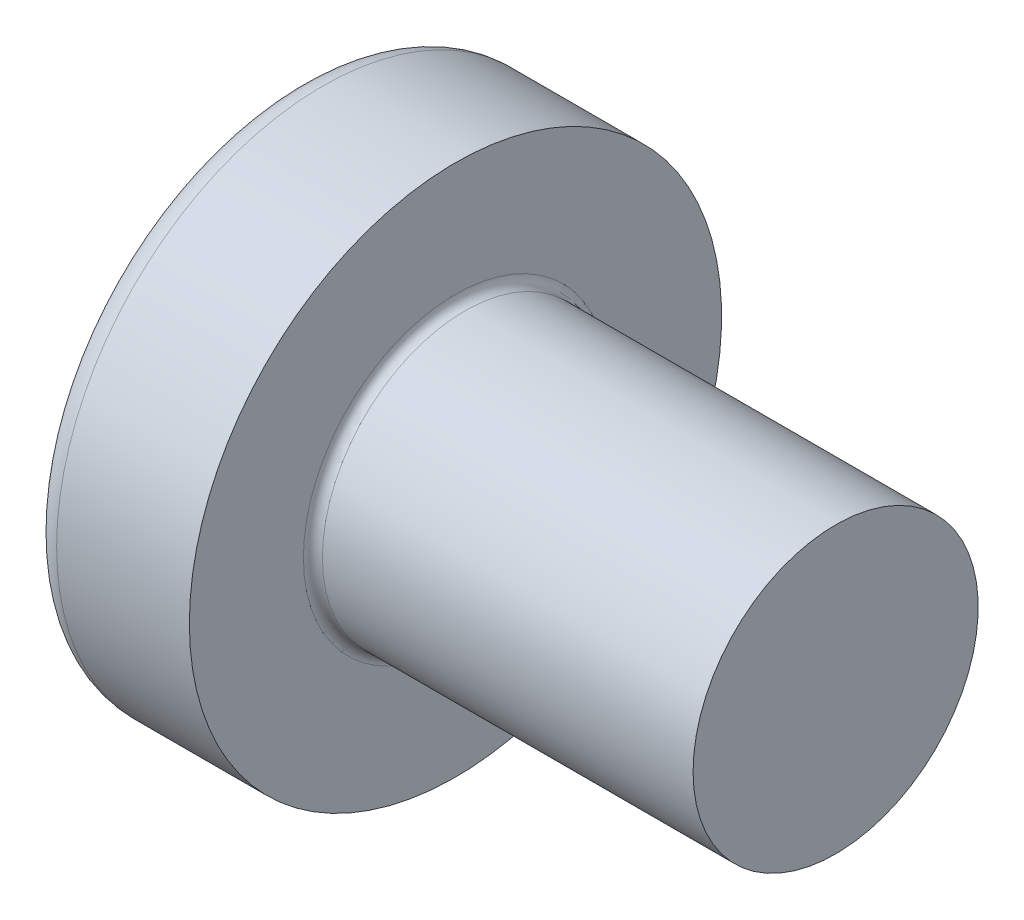
ISO-10303-21;
HEADER;
FILE_DESCRIPTION(('STEP AP214'),'2;1');
FILE_NAME('part.step','',(''),(''),'','','');
FILE_SCHEMA(('AUTOMOTIVE_DESIGN { 1 0 10303 214 1 1 1 1 }'));
ENDSEC;
DATA;
#1=APPLICATION_CONTEXT('core data for automotive mechanical design processes');
#2=APPLICATION_PROTOCOL_DEFINITION('international standard','automotive_design',2000,#1);
#3=PRODUCT_CONTEXT('',#1,'mechanical');
#4=PRODUCT('Part','Part','',(#3));
#5=PRODUCT_RELATED_PRODUCT_CATEGORY('part','',(#4));
#6=PRODUCT_DEFINITION_FORMATION('','',#4);
#7=PRODUCT_DEFINITION_CONTEXT('part definition',#1,'design');
#8=PRODUCT_DEFINITION('design','',#6,#7);
#9=PRODUCT_DEFINITION_SHAPE('','',#8);
#10=(LENGTH_UNIT() NAMED_UNIT(*) SI_UNIT(.MILLI.,.METRE.));
#11=(NAMED_UNIT(*) PLANE_ANGLE_UNIT() SI_UNIT($,.RADIAN.));
#12=(NAMED_UNIT(*) SI_UNIT($,.STERADIAN.) SOLID_ANGLE_UNIT());
#13=UNCERTAINTY_MEASURE_WITH_UNIT(LENGTH_MEASURE(1.E-05),#10,'distance_accuracy_value','');
#14=(GEOMETRIC_REPRESENTATION_CONTEXT(3) GLOBAL_UNCERTAINTY_ASSIGNED_CONTEXT((#13)) GLOBAL_UNIT_ASSIGNED_CONTEXT((#10,
#11,#12)) REPRESENTATION_CONTEXT('',''));
#15=CARTESIAN_POINT('',(0.,0.,0.));
#16=DIRECTION('',(0.,0.,1.));
#17=DIRECTION('',(1.,0.,0.));
#18=AXIS2_PLACEMENT_3D('',#15,#16,#17);
#19=CARTESIAN_POINT('',(5.,0.,0.));
#20=DIRECTION('',(-1.,0.,0.));
#21=DIRECTION('',(0.,1.,0.));
#22=AXIS2_PLACEMENT_3D('',#19,#20,#21);
#23=SPHERICAL_SURFACE('',#22,5.);
#24=CARTESIAN_POINT('',(0.775371598933733,0.,0.));
#25=DIRECTION('',(-1.,0.,0.));
#26=DIRECTION('',(0.,0.,1.));
#27=AXIS2_PLACEMENT_3D('',#24,#25,#26);
#28=CIRCLE('',#27,2.67441860465116);
#29=CARTESIAN_POINT('',(0.775371598933733,0.,2.67441860465116));
#30=VERTEX_POINT('',#29);
#31=EDGE_CURVE('E238',#30,#30,#28,.T.);
#32=ORIENTED_EDGE('',*,*,#31,.T.);
#33=EDGE_LOOP('',(#32));
#34=FACE_BOUND('',#33,.T.);
#35=CARTESIAN_POINT('',(0.0457951200896417,0.,0.));
#36=DIRECTION('',(1.,0.,0.));
#37=DIRECTION('',(0.,0.,-1.));
#38=AXIS2_PLACEMENT_3D('',#35,#36,#37);
#39=CIRCLE('',#38,0.675169614150692);
#40=CARTESIAN_POINT('',(0.0457951200896417,-0.369999999999997,-0.564760133040919));
#41=VERTEX_POINT('',#40);
#42=CARTESIAN_POINT('',(0.0457951200896417,-0.564760133040924,-0.37));
#43=VERTEX_POINT('',#42);
#44=EDGE_CURVE('E374',#41,#43,#39,.F.);
#45=ORIENTED_EDGE('',*,*,#44,.F.);
#46=CARTESIAN_POINT('',(5.,-0.370000000000002,0.));
#47=DIRECTION('',(0.,1.,0.));
#48=DIRECTION('',(0.,0.,1.));
#49=AXIS2_PLACEMENT_3D('',#46,#47,#48);
#50=CIRCLE('',#49,4.98629120689917);
#51=CARTESIAN_POINT('',(0.187869734228639,-0.369999999999995,-1.30633162146802));
#52=VERTEX_POINT('',#51);
#53=EDGE_CURVE('E300',#52,#41,#50,.T.);
#54=ORIENTED_EDGE('',*,*,#53,.F.);
#55=CARTESIAN_POINT('',(4.56358262530798,0.,0.875317983305919));
#56=DIRECTION('',(0.446197753347436,0.,-0.894934391398443));
#57=DIRECTION('',(-0.894934391398443,0.,-0.446197753347436));
#58=AXIS2_PLACEMENT_3D('',#55,#56,#57);
#59=CIRCLE('',#58,4.90340272700175);
#60=CARTESIAN_POINT('',(0.187869734228639,0.370000000000005,-1.30633162146802));
#61=VERTEX_POINT('',#60);
#62=EDGE_CURVE('E272',#52,#61,#59,.T.);
#63=ORIENTED_EDGE('',*,*,#62,.T.);
#64=CARTESIAN_POINT('',(5.,0.369999999999999,0.));
#65=DIRECTION('',(0.,-1.,0.));
#66=DIRECTION('',(0.,0.,-1.));
#67=AXIS2_PLACEMENT_3D('',#64,#65,#66);
#68=CIRCLE('',#67,4.98629120689917);
#69=CARTESIAN_POINT('',(0.0457951200896424,0.370000000000002,-0.564760133040916));
#70=VERTEX_POINT('',#69);
#71=EDGE_CURVE('E327',#70,#61,#68,.T.);
#72=ORIENTED_EDGE('',*,*,#71,.F.);
#73=CARTESIAN_POINT('',(0.0457951200896417,0.564760133040913,-0.37));
#74=VERTEX_POINT('',#73);
#75=EDGE_CURVE('E393',#74,#70,#39,.F.);
#76=ORIENTED_EDGE('',*,*,#75,.F.);
#77=CARTESIAN_POINT('',(5.,0.,-0.369999999999999));
#78=DIRECTION('',(0.,0.,1.));
#79=DIRECTION('',(1.,0.,0.));
#80=AXIS2_PLACEMENT_3D('',#77,#78,#79);
#81=CIRCLE('',#80,4.98629120689917);
#82=CARTESIAN_POINT('',(0.187869734228641,1.30633162146802,-0.37));
#83=VERTEX_POINT('',#82);
#84=EDGE_CURVE('E266',#83,#74,#81,.T.);
#85=ORIENTED_EDGE('',*,*,#84,.F.);
#86=CARTESIAN_POINT('',(4.56358262530798,-0.875317983305921,0.));
#87=DIRECTION('',(0.446197753347436,0.894934391398443,0.));
#88=DIRECTION('',(-0.894934391398443,0.446197753347436,0.));
#89=AXIS2_PLACEMENT_3D('',#86,#87,#88);
#90=CIRCLE('',#89,4.90340272700175);
#91=CARTESIAN_POINT('',(0.187869734228641,1.30633162146802,0.370000000000001));
#92=VERTEX_POINT('',#91);
#93=EDGE_CURVE('E269',#83,#92,#90,.T.);
#94=ORIENTED_EDGE('',*,*,#93,.T.);
#95=CARTESIAN_POINT('',(5.,0.,0.370000000000002));
#96=DIRECTION('',(0.,0.,-1.));
#97=DIRECTION('',(-1.,0.,0.));
#98=AXIS2_PLACEMENT_3D('',#95,#96,#97);
#99=CIRCLE('',#98,4.98629120689917);
#100=CARTESIAN_POINT('',(0.0457951200896417,0.564760133040909,0.369999999999999));
#101=VERTEX_POINT('',#100);
#102=EDGE_CURVE('E262',#101,#92,#99,.T.);
#103=ORIENTED_EDGE('',*,*,#102,.F.);
#104=CARTESIAN_POINT('',(0.0457951200896434,0.369999999999998,0.564760133040918));
#105=VERTEX_POINT('',#104);
#106=EDGE_CURVE('E431',#105,#101,#39,.F.);
#107=ORIENTED_EDGE('',*,*,#106,.F.);
#108=CARTESIAN_POINT('',(0.18786973422864,0.369999999999995,1.30633162146802));
#109=VERTEX_POINT('',#108);
#110=EDGE_CURVE('E282',#109,#105,#68,.T.);
#111=ORIENTED_EDGE('',*,*,#110,.F.);
#112=CARTESIAN_POINT('',(4.56358262530798,0.,-0.87531798330592));
#113=DIRECTION('',(0.446197753347436,0.,0.894934391398443));
#114=DIRECTION('',(0.894934391398443,0.,-0.446197753347436));
#115=AXIS2_PLACEMENT_3D('',#112,#113,#114);
#116=CIRCLE('',#115,4.90340272700175);
#117=CARTESIAN_POINT('',(0.187869734228639,-0.370000000000006,1.30633162146802));
#118=VERTEX_POINT('',#117);
#119=EDGE_CURVE('E49',#109,#118,#116,.T.);
#120=ORIENTED_EDGE('',*,*,#119,.T.);
#121=CARTESIAN_POINT('',(0.0457951200896408,-0.370000000000001,0.564760133040917));
#122=VERTEX_POINT('',#121);
#123=EDGE_CURVE('E279',#122,#118,#50,.T.);
#124=ORIENTED_EDGE('',*,*,#123,.F.);
#125=CARTESIAN_POINT('',(0.0457951200896417,-0.56476013304092,0.369999999999999));
#126=VERTEX_POINT('',#125);
#127=EDGE_CURVE('E392',#126,#122,#39,.F.);
#128=ORIENTED_EDGE('',*,*,#127,.F.);
#129=CARTESIAN_POINT('',(0.187869734228638,-1.30633162146802,0.369999999999999));
#130=VERTEX_POINT('',#129);
#131=EDGE_CURVE('E263',#130,#126,#99,.T.);
#132=ORIENTED_EDGE('',*,*,#131,.F.);
#133=CARTESIAN_POINT('',(4.56358262530798,0.875317983305917,0.));
#134=DIRECTION('',(0.446197753347436,-0.894934391398443,0.));
#135=DIRECTION('',(0.894934391398443,0.446197753347436,0.));
#136=AXIS2_PLACEMENT_3D('',#133,#134,#135);
#137=CIRCLE('',#136,4.90340272700175);
#138=CARTESIAN_POINT('',(0.187869734228638,-1.30633162146802,-0.37));
#139=VERTEX_POINT('',#138);
#140=EDGE_CURVE('E259',#130,#139,#137,.T.);
#141=ORIENTED_EDGE('',*,*,#140,.T.);
#142=EDGE_CURVE('E64',#43,#139,#81,.T.);
#143=ORIENTED_EDGE('',*,*,#142,.F.);
#144=EDGE_LOOP('',(#45,#54,#63,#72,#76,#85,#94,#103,#107,#111,#120,#124,#128,#132,#141,#143));
#145=FACE_BOUND('',#144,.T.);
#146=ADVANCED_FACE('F35',(#34,#145),#23,.T.);
#147=CARTESIAN_POINT('',(1.75,0.527482331818931,-0.37));
#148=DIRECTION('',(0.,0.,1.));
#149=DIRECTION('',(1.,0.,0.));
#150=AXIS2_PLACEMENT_3D('',#147,#148,#149);
#151=PLANE('',#150);
#152=ORIENTED_EDGE('',*,*,#84,.T.);
#153=CARTESIAN_POINT('',(-0.987293237069636,0.649401255968442,-0.37));
#154=CARTESIAN_POINT('',(-0.781914975331302,0.632865887004023,-0.37));
#155=CARTESIAN_POINT('',(-0.576547882405889,0.616188977636102,-0.37));
#156=CARTESIAN_POINT('',(-0.165841599235441,0.582441031964983,-0.37));
#157=CARTESIAN_POINT('',(0.0394975903016328,0.5653699870555,-0.37));
#158=CARTESIAN_POINT('',(0.4501334754206,0.530723441326706,-0.37));
#159=CARTESIAN_POINT('',(0.65543017101234,0.513147940624409,-0.37));
#160=CARTESIAN_POINT('',(1.06596140178858,0.477314957984981,-0.37));
#161=CARTESIAN_POINT('',(1.27119593782008,0.459057485804908,-0.37));
#162=CARTESIAN_POINT('',(1.61065292367297,0.428051938687225,-0.37));
#163=CARTESIAN_POINT('',(1.74490059997313,0.415580824989367,-0.37));
#164=CARTESIAN_POINT('',(2.01334321764434,0.390092023403371,-0.37));
#165=CARTESIAN_POINT('',(2.14753815936247,0.377074339175719,-0.37));
#166=CARTESIAN_POINT('',(2.41586354153627,0.350315629451146,-0.37));
#167=CARTESIAN_POINT('',(2.54999397846979,0.336574568175918,-0.37));
#168=CARTESIAN_POINT('',(2.8181417329714,0.308004077740054,-0.37));
#169=CARTESIAN_POINT('',(2.95215904766802,0.29317462174519,-0.37));
#170=CARTESIAN_POINT('',(3.08609550685347,0.277618485069874,-0.37));
#171=B_SPLINE_CURVE_WITH_KNOTS('',3,(#153,#154,#155,#156,#157,#158,#159,#160,#161,#162,#163,
#164,#165,#166,#167,#168,#169,#170),.UNSPECIFIED.,.F.,.F.,(4,2,2,2,2,2,2,2,4),(0.,
0.61812879398981,1.23627109813549,1.85441325889711,2.47254657920086,2.87702276221884,
3.28149623681437,3.68598973554218,4.09049321035586),.UNSPECIFIED.);
#172=CARTESIAN_POINT('',(1.75,0.415013252800437,-0.37));
#173=VERTEX_POINT('',#172);
#174=EDGE_CURVE('E416',#74,#173,#171,.T.);
#175=ORIENTED_EDGE('',*,*,#174,.T.);
#176=DIRECTION('',(0.,1.,0.));
#177=VECTOR('',#176,1.);
#178=CARTESIAN_POINT('',(1.75,-0.527482331818932,-0.37));
#179=LINE('',#178,#177);
#180=CARTESIAN_POINT('',(1.75,0.527482331818931,-0.37));
#181=VERTEX_POINT('',#180);
#182=EDGE_CURVE('E356',#173,#181,#179,.T.);
#183=ORIENTED_EDGE('',*,*,#182,.T.);
#184=DIRECTION('',(0.894934391398442,-0.446197753347436,0.));
#185=VECTOR('',#184,1.);
#186=CARTESIAN_POINT('',(0.,1.4,-0.37));
#187=LINE('',#186,#185);
#188=EDGE_CURVE('E239',#83,#181,#187,.T.);
#189=ORIENTED_EDGE('',*,*,#188,.F.);
#190=EDGE_LOOP('',(#152,#175,#183,#189));
#191=FACE_BOUND('',#190,.T.);
#192=ADVANCED_FACE('F194',(#191),#151,.T.);
#193=CARTESIAN_POINT('',(1.75,-0.527482331818932,-0.37));
#194=VERTEX_POINT('',#193);
#195=CARTESIAN_POINT('',(1.75,-0.415013252800437,-0.37));
#196=VERTEX_POINT('',#195);
#197=EDGE_CURVE('E247',#194,#196,#179,.T.);
#198=ORIENTED_EDGE('',*,*,#197,.T.);
#199=CARTESIAN_POINT('',(-0.987293237069636,-0.649401255968442,-0.37));
#200=CARTESIAN_POINT('',(-0.781914975331303,-0.632865887004023,-0.37));
#201=CARTESIAN_POINT('',(-0.57654788240589,-0.616188977636102,-0.37));
#202=CARTESIAN_POINT('',(-0.165841599235441,-0.582441031964983,-0.37));
#203=CARTESIAN_POINT('',(0.0394975903016326,-0.5653699870555,-0.37));
#204=CARTESIAN_POINT('',(0.4501334754206,-0.530723441326706,-0.37));
#205=CARTESIAN_POINT('',(0.65543017101234,-0.513147940624409,-0.37));
#206=CARTESIAN_POINT('',(1.06596140178858,-0.477314957984981,-0.37));
#207=CARTESIAN_POINT('',(1.27119593782008,-0.459057485804908,-0.37));
#208=CARTESIAN_POINT('',(1.61065292367297,-0.428051938687225,-0.37));
#209=CARTESIAN_POINT('',(1.74490059997313,-0.415580824989368,-0.37));
#210=CARTESIAN_POINT('',(2.01334321764433,-0.390092023403371,-0.37));
#211=CARTESIAN_POINT('',(2.14753815936247,-0.377074339175718,-0.37));
#212=CARTESIAN_POINT('',(2.41586354153627,-0.350315629451146,-0.37));
#213=CARTESIAN_POINT('',(2.54999397846979,-0.336574568175918,-0.37));
#214=CARTESIAN_POINT('',(2.8181417329714,-0.308004077740054,-0.37));
#215=CARTESIAN_POINT('',(2.95215904766802,-0.29317462174519,-0.37));
#216=CARTESIAN_POINT('',(3.08609550685347,-0.277618485069873,-0.37));
#217=B_SPLINE_CURVE_WITH_KNOTS('',3,(#199,#200,#201,#202,#203,#204,#205,#206,#207,#208,#209,
#210,#211,#212,#213,#214,#215,#216),.UNSPECIFIED.,.F.,.F.,(4,2,2,2,2,2,2,2,4),(0.,
0.61812879398981,1.2362710981355,1.85441325889711,2.47254657920086,2.87702276221884,
3.28149623681437,3.68598973554218,4.09049321035587),.UNSPECIFIED.);
#218=EDGE_CURVE('E391',#196,#43,#217,.F.);
#219=ORIENTED_EDGE('',*,*,#218,.T.);
#220=ORIENTED_EDGE('',*,*,#142,.T.);
#221=DIRECTION('',(0.894934391398443,0.446197753347436,0.));
#222=VECTOR('',#221,1.);
#223=CARTESIAN_POINT('',(0.,-1.4,-0.37));
#224=LINE('',#223,#222);
#225=EDGE_CURVE('E330',#139,#194,#224,.T.);
#226=ORIENTED_EDGE('',*,*,#225,.T.);
#227=EDGE_LOOP('',(#198,#219,#220,#226));
#228=FACE_BOUND('',#227,.T.);
#229=ADVANCED_FACE('F200',(#228),#151,.T.);
#230=CARTESIAN_POINT('',(1.75,-0.527482331818932,0.37));
#231=DIRECTION('',(0.,0.,-1.));
#232=DIRECTION('',(-1.,0.,0.));
#233=AXIS2_PLACEMENT_3D('',#230,#231,#232);
#234=PLANE('',#233);
#235=DIRECTION('',(0.,-1.,0.));
#236=VECTOR('',#235,1.);
#237=CARTESIAN_POINT('',(1.75,0.527482331818931,0.37));
#238=LINE('',#237,#236);
#239=CARTESIAN_POINT('',(1.75,0.527482331818931,0.37));
#240=VERTEX_POINT('',#239);
#241=CARTESIAN_POINT('',(1.75,0.415013252800437,0.37));
#242=VERTEX_POINT('',#241);
#243=EDGE_CURVE('E339',#240,#242,#238,.T.);
#244=ORIENTED_EDGE('',*,*,#243,.T.);
#245=CARTESIAN_POINT('',(-0.987293237053716,0.649401255967162,0.369999999999998));
#246=CARTESIAN_POINT('',(-0.781914975317084,0.632865887002872,0.369999999999998));
#247=CARTESIAN_POINT('',(-0.576547882393372,0.616188977635082,0.369999999999998));
#248=CARTESIAN_POINT('',(-0.165841599226327,0.582441031964228,0.369999999999999));
#249=CARTESIAN_POINT('',(0.0394975903090454,0.56536998705488,0.369999999999999));
#250=CARTESIAN_POINT('',(0.450133475422572,0.530723441326535,0.369999999999999));
#251=CARTESIAN_POINT('',(0.655430171010573,0.513147940624557,0.369999999999999));
#252=CARTESIAN_POINT('',(1.06596140177934,0.477314957985794,0.37));
#253=CARTESIAN_POINT('',(1.2711959378071,0.459057485806066,0.37));
#254=CARTESIAN_POINT('',(1.61065292365626,0.428051938688769,0.37));
#255=CARTESIAN_POINT('',(1.74490059995643,0.415580824990931,0.37));
#256=CARTESIAN_POINT('',(2.01334321762763,0.390092023404979,0.37));
#257=CARTESIAN_POINT('',(2.14753815934577,0.377074339177353,0.37));
#258=CARTESIAN_POINT('',(2.41586354151957,0.350315629452842,0.37));
#259=CARTESIAN_POINT('',(2.5499939784531,0.336574568177649,0.370000000000001));
#260=CARTESIAN_POINT('',(2.81814173295471,0.308004077741874,0.370000000000001));
#261=CARTESIAN_POINT('',(2.95215904765134,0.293174621747063,0.370000000000001));
#262=CARTESIAN_POINT('',(3.0860955068368,0.277618485071814,0.370000000000001));
#263=B_SPLINE_CURVE_WITH_KNOTS('',3,(#245,#246,#247,#248,#249,#250,#251,#252,#253,#254,#255,
#256,#257,#258,#259,#260,#261,#262),.UNSPECIFIED.,.F.,.F.,(4,2,2,2,2,2,2,2,4),(0.,
0.618128793984691,1.23627109812525,1.85441325887562,2.4725465791681,2.87702276218609,
3.28149623678161,3.68598973550942,4.09049321032311),.UNSPECIFIED.);
#264=EDGE_CURVE('E432',#242,#101,#263,.F.);
#265=ORIENTED_EDGE('',*,*,#264,.T.);
#266=ORIENTED_EDGE('',*,*,#102,.T.);
#267=DIRECTION('',(0.894934391398442,-0.446197753347436,0.));
#268=VECTOR('',#267,1.);
#269=CARTESIAN_POINT('',(0.,1.4,0.37));
#270=LINE('',#269,#268);
#271=EDGE_CURVE('E244',#92,#240,#270,.T.);
#272=ORIENTED_EDGE('',*,*,#271,.T.);
#273=EDGE_LOOP('',(#244,#265,#266,#272));
#274=FACE_BOUND('',#273,.T.);
#275=ADVANCED_FACE('F412',(#274),#234,.T.);
#276=ORIENTED_EDGE('',*,*,#131,.T.);
#277=CARTESIAN_POINT('',(-0.987293237053716,-0.649401255967162,0.369999999999998));
#278=CARTESIAN_POINT('',(-0.781914975317084,-0.632865887002872,0.369999999999998));
#279=CARTESIAN_POINT('',(-0.576547882393373,-0.616188977635082,0.369999999999999));
#280=CARTESIAN_POINT('',(-0.165841599226327,-0.582441031964228,0.369999999999999));
#281=CARTESIAN_POINT('',(0.0394975903090454,-0.56536998705488,0.369999999999999));
#282=CARTESIAN_POINT('',(0.450133475422572,-0.530723441326535,0.369999999999999));
#283=CARTESIAN_POINT('',(0.655430171010573,-0.513147940624557,0.369999999999999));
#284=CARTESIAN_POINT('',(1.06596140177934,-0.477314957985794,0.37));
#285=CARTESIAN_POINT('',(1.2711959378071,-0.459057485806066,0.37));
#286=CARTESIAN_POINT('',(1.61065292365626,-0.428051938688769,0.37));
#287=CARTESIAN_POINT('',(1.74490059995643,-0.415580824990931,0.37));
#288=CARTESIAN_POINT('',(2.01334321762763,-0.390092023404979,0.37));
#289=CARTESIAN_POINT('',(2.14753815934577,-0.377074339177353,0.37));
#290=CARTESIAN_POINT('',(2.41586354151957,-0.350315629452842,0.370000000000001));
#291=CARTESIAN_POINT('',(2.5499939784531,-0.336574568177649,0.370000000000001));
#292=CARTESIAN_POINT('',(2.81814173295471,-0.308004077741874,0.370000000000001));
#293=CARTESIAN_POINT('',(2.95215904765134,-0.293174621747064,0.370000000000001));
#294=CARTESIAN_POINT('',(3.0860955068368,-0.277618485071814,0.370000000000001));
#295=B_SPLINE_CURVE_WITH_KNOTS('',3,(#277,#278,#279,#280,#281,#282,#283,#284,#285,#286,#287,
#288,#289,#290,#291,#292,#293,#294),.UNSPECIFIED.,.F.,.F.,(4,2,2,2,2,2,2,2,4),(0.,
0.618128793984691,1.23627109812525,1.85441325887562,2.4725465791681,2.87702276218609,
3.28149623678161,3.68598973550942,4.09049321032311),.UNSPECIFIED.);
#296=CARTESIAN_POINT('',(1.75,-0.415013252800437,0.370000000000001));
#297=VERTEX_POINT('',#296);
#298=EDGE_CURVE('E453',#126,#297,#295,.T.);
#299=ORIENTED_EDGE('',*,*,#298,.T.);
#300=CARTESIAN_POINT('',(1.75,-0.527482331818932,0.37));
#301=VERTEX_POINT('',#300);
#302=EDGE_CURVE('E341',#297,#301,#238,.T.);
#303=ORIENTED_EDGE('',*,*,#302,.T.);
#304=DIRECTION('',(0.894934391398443,0.446197753347436,0.));
#305=VECTOR('',#304,1.);
#306=CARTESIAN_POINT('',(0.,-1.4,0.369999999999999));
#307=LINE('',#306,#305);
#308=EDGE_CURVE('E332',#130,#301,#307,.T.);
#309=ORIENTED_EDGE('',*,*,#308,.F.);
#310=EDGE_LOOP('',(#276,#299,#303,#309));
#311=FACE_BOUND('',#310,.T.);
#312=ADVANCED_FACE('F515',(#311),#234,.T.);
#313=CARTESIAN_POINT('',(1.75,0.527482331818931,0.37));
#314=DIRECTION('',(0.446197753347436,0.894934391398443,0.));
#315=DIRECTION('',(-0.894934391398443,0.446197753347436,0.));
#316=AXIS2_PLACEMENT_3D('',#313,#314,#315);
#317=PLANE('',#316);
#318=CARTESIAN_POINT('',(2.6696526882832,0.0689604923233255,0.));
#319=DIRECTION('',(0.446197753347436,0.894934391398443,0.));
#320=DIRECTION('',(-0.894934391398443,0.446197753347436,0.));
#321=AXIS2_PLACEMENT_3D('',#318,#319,#320);
#322=ELLIPSE('',#321,1.10195897609153,0.486831694838766);
#323=CARTESIAN_POINT('',(1.75,0.527482331818932,0.175779377683682));
#324=VERTEX_POINT('',#323);
#325=CARTESIAN_POINT('',(1.75,0.527482331818932,-0.175779377683682));
#326=VERTEX_POINT('',#325);
#327=EDGE_CURVE('E305',#324,#326,#322,.F.);
#328=ORIENTED_EDGE('',*,*,#327,.F.);
#329=DIRECTION('',(0.,0.,-1.));
#330=VECTOR('',#329,1.);
#331=CARTESIAN_POINT('',(1.75,0.527482331818931,0.37));
#332=LINE('',#331,#330);
#333=EDGE_CURVE('E342',#240,#324,#332,.T.);
#334=ORIENTED_EDGE('',*,*,#333,.F.);
#335=ORIENTED_EDGE('',*,*,#271,.F.);
#336=ORIENTED_EDGE('',*,*,#93,.F.);
#337=ORIENTED_EDGE('',*,*,#188,.T.);
#338=EDGE_CURVE('E344',#326,#181,#332,.T.);
#339=ORIENTED_EDGE('',*,*,#338,.F.);
#340=EDGE_LOOP('',(#328,#334,#335,#336,#337,#339));
#341=FACE_BOUND('',#340,.T.);
#342=ADVANCED_FACE('F410',(#341),#317,.F.);
#343=CARTESIAN_POINT('',(1.75,-0.527482331818932,-0.37));
#344=DIRECTION('',(0.446197753347436,-0.894934391398443,0.));
#345=DIRECTION('',(0.894934391398443,0.446197753347436,0.));
#346=AXIS2_PLACEMENT_3D('',#343,#344,#345);
#347=PLANE('',#346);
#348=CARTESIAN_POINT('',(2.6696526882832,-0.0689604923233255,0.));
#349=DIRECTION('',(0.446197753347436,-0.894934391398443,0.));
#350=DIRECTION('',(-0.894934391398443,-0.446197753347436,0.));
#351=AXIS2_PLACEMENT_3D('',#348,#349,#350);
#352=ELLIPSE('',#351,1.10195897609154,0.486831694838766);
#353=CARTESIAN_POINT('',(1.75,-0.527482331818932,-0.175779377683679));
#354=VERTEX_POINT('',#353);
#355=CARTESIAN_POINT('',(1.75,-0.527482331818932,0.175779377683679));
#356=VERTEX_POINT('',#355);
#357=EDGE_CURVE('E459',#354,#356,#352,.F.);
#358=ORIENTED_EDGE('',*,*,#357,.F.);
#359=DIRECTION('',(0.,0.,1.));
#360=VECTOR('',#359,1.);
#361=CARTESIAN_POINT('',(1.75,-0.527482331818932,-0.37));
#362=LINE('',#361,#360);
#363=EDGE_CURVE('E335',#194,#354,#362,.T.);
#364=ORIENTED_EDGE('',*,*,#363,.F.);
#365=ORIENTED_EDGE('',*,*,#225,.F.);
#366=ORIENTED_EDGE('',*,*,#140,.F.);
#367=ORIENTED_EDGE('',*,*,#308,.T.);
#368=EDGE_CURVE('E338',#356,#301,#362,.T.);
#369=ORIENTED_EDGE('',*,*,#368,.F.);
#370=EDGE_LOOP('',(#358,#364,#365,#366,#367,#369));
#371=FACE_BOUND('',#370,.T.);
#372=ADVANCED_FACE('F507',(#371),#347,.F.);
#373=CARTESIAN_POINT('',(1.75,-0.527482331818932,-0.37));
#374=DIRECTION('',(1.,0.,0.));
#375=DIRECTION('',(0.,0.,-1.));
#376=AXIS2_PLACEMENT_3D('',#373,#374,#375);
#377=PLANE('',#376);
#378=CARTESIAN_POINT('',(1.75,0.,0.));
#379=DIRECTION('',(-1.,0.,0.));
#380=DIRECTION('',(0.,0.,1.));
#381=AXIS2_PLACEMENT_3D('',#378,#379,#380);
#382=CIRCLE('',#381,0.556);
#383=CARTESIAN_POINT('',(1.75,-0.175779377683679,-0.527482331818933));
#384=VERTEX_POINT('',#383);
#385=CARTESIAN_POINT('',(1.75,-0.369999999999999,-0.415013252800438));
#386=VERTEX_POINT('',#385);
#387=EDGE_CURVE('E56',#384,#386,#382,.T.);
#388=ORIENTED_EDGE('',*,*,#387,.F.);
#389=DIRECTION('',(0.,-1.,0.));
#390=VECTOR('',#389,1.);
#391=CARTESIAN_POINT('',(1.75,0.370000000000002,-0.527482331818931));
#392=LINE('',#391,#390);
#393=CARTESIAN_POINT('',(1.75,-0.369999999999998,-0.527482331818933));
#394=VERTEX_POINT('',#393);
#395=EDGE_CURVE('E315',#384,#394,#392,.T.);
#396=ORIENTED_EDGE('',*,*,#395,.T.);
#397=DIRECTION('',(0.,0.,-1.));
#398=VECTOR('',#397,1.);
#399=CARTESIAN_POINT('',(1.75,-0.370000000000002,0.52748233181893));
#400=LINE('',#399,#398);
#401=EDGE_CURVE('E319',#386,#394,#400,.T.);
#402=ORIENTED_EDGE('',*,*,#401,.F.);
#403=EDGE_LOOP('',(#388,#396,#402));
#404=FACE_BOUND('',#403,.T.);
#405=ADVANCED_FACE('F380',(#404),#377,.F.);
#406=EDGE_CURVE('E385',#196,#354,#382,.T.);
#407=ORIENTED_EDGE('',*,*,#406,.F.);
#408=ORIENTED_EDGE('',*,*,#197,.F.);
#409=ORIENTED_EDGE('',*,*,#363,.T.);
#410=EDGE_LOOP('',(#407,#408,#409));
#411=FACE_BOUND('',#410,.T.);
#412=ADVANCED_FACE('F514',(#411),#377,.F.);
#413=EDGE_CURVE('E522',#356,#297,#382,.T.);
#414=ORIENTED_EDGE('',*,*,#413,.F.);
#415=ORIENTED_EDGE('',*,*,#368,.T.);
#416=ORIENTED_EDGE('',*,*,#302,.F.);
#417=EDGE_LOOP('',(#414,#415,#416));
#418=FACE_BOUND('',#417,.T.);
#419=ADVANCED_FACE('F503',(#418),#377,.F.);
#420=CARTESIAN_POINT('',(1.75,-0.370000000000001,0.415013252800436));
#421=VERTEX_POINT('',#420);
#422=CARTESIAN_POINT('',(1.75,-0.175779377683685,0.527482331818931));
#423=VERTEX_POINT('',#422);
#424=EDGE_CURVE('E490',#421,#423,#382,.T.);
#425=ORIENTED_EDGE('',*,*,#424,.F.);
#426=CARTESIAN_POINT('',(1.75,-0.370000000000002,0.52748233181893));
#427=VERTEX_POINT('',#426);
#428=EDGE_CURVE('E316',#427,#421,#400,.T.);
#429=ORIENTED_EDGE('',*,*,#428,.F.);
#430=DIRECTION('',(0.,1.,0.));
#431=VECTOR('',#430,1.);
#432=CARTESIAN_POINT('',(1.75,-0.370000000000002,0.52748233181893));
#433=LINE('',#432,#431);
#434=EDGE_CURVE('E320',#427,#423,#433,.T.);
#435=ORIENTED_EDGE('',*,*,#434,.T.);
#436=EDGE_LOOP('',(#425,#429,#435));
#437=FACE_BOUND('',#436,.T.);
#438=ADVANCED_FACE('F488',(#437),#377,.F.);
#439=CARTESIAN_POINT('',(1.75,0.175779377683682,0.527482331818932));
#440=VERTEX_POINT('',#439);
#441=CARTESIAN_POINT('',(1.75,0.369999999999998,0.415013252800439));
#442=VERTEX_POINT('',#441);
#443=EDGE_CURVE('E386',#440,#442,#382,.T.);
#444=ORIENTED_EDGE('',*,*,#443,.F.);
#445=CARTESIAN_POINT('',(1.75,0.369999999999998,0.527482331818932));
#446=VERTEX_POINT('',#445);
#447=EDGE_CURVE('E323',#440,#446,#433,.T.);
#448=ORIENTED_EDGE('',*,*,#447,.T.);
#449=DIRECTION('',(0.,0.,1.));
#450=VECTOR('',#449,1.);
#451=CARTESIAN_POINT('',(1.75,0.370000000000002,-0.527482331818931));
#452=LINE('',#451,#450);
#453=EDGE_CURVE('E297',#442,#446,#452,.T.);
#454=ORIENTED_EDGE('',*,*,#453,.F.);
#455=EDGE_LOOP('',(#444,#448,#454));
#456=FACE_BOUND('',#455,.T.);
#457=ADVANCED_FACE('F496',(#456),#377,.F.);
#458=EDGE_CURVE('E473',#242,#324,#382,.T.);
#459=ORIENTED_EDGE('',*,*,#458,.F.);
#460=ORIENTED_EDGE('',*,*,#243,.F.);
#461=ORIENTED_EDGE('',*,*,#333,.T.);
#462=EDGE_LOOP('',(#459,#460,#461));
#463=FACE_BOUND('',#462,.T.);
#464=ADVANCED_FACE('F498',(#463),#377,.F.);
#465=EDGE_CURVE('E471',#326,#173,#382,.T.);
#466=ORIENTED_EDGE('',*,*,#465,.F.);
#467=ORIENTED_EDGE('',*,*,#338,.T.);
#468=ORIENTED_EDGE('',*,*,#182,.F.);
#469=EDGE_LOOP('',(#466,#467,#468));
#470=FACE_BOUND('',#469,.T.);
#471=ADVANCED_FACE('F443',(#470),#377,.F.);
#472=CARTESIAN_POINT('',(1.75,-0.369999999999998,-0.527482331818933));
#473=DIRECTION('',(0.,1.,0.));
#474=DIRECTION('',(-1.,0.,0.));
#475=AXIS2_PLACEMENT_3D('',#472,#473,#474);
#476=PLANE('',#475);
#477=ORIENTED_EDGE('',*,*,#428,.T.);
#478=CARTESIAN_POINT('',(-0.987293237069635,-0.37,0.649401255968442));
#479=CARTESIAN_POINT('',(-0.781914975331302,-0.37,0.632865887004023));
#480=CARTESIAN_POINT('',(-0.576547882405888,-0.370000000000001,0.616188977636102));
#481=CARTESIAN_POINT('',(-0.16584159923544,-0.370000000000001,0.582441031964982));
#482=CARTESIAN_POINT('',(0.0394975903016338,-0.370000000000001,0.565369987055499));
#483=CARTESIAN_POINT('',(0.450133475420601,-0.370000000000001,0.530723441326705));
#484=CARTESIAN_POINT('',(0.655430171012341,-0.370000000000001,0.513147940624408));
#485=CARTESIAN_POINT('',(1.06596140178858,-0.370000000000001,0.47731495798498));
#486=CARTESIAN_POINT('',(1.27119593782008,-0.370000000000001,0.459057485804906));
#487=CARTESIAN_POINT('',(1.61065292367297,-0.370000000000001,0.428051938687223));
#488=CARTESIAN_POINT('',(1.74490059997313,-0.370000000000001,0.415580824989366));
#489=CARTESIAN_POINT('',(2.01334321764434,-0.370000000000002,0.390092023403369));
#490=CARTESIAN_POINT('',(2.14753815936247,-0.370000000000002,0.377074339175717));
#491=CARTESIAN_POINT('',(2.41586354153627,-0.370000000000002,0.350315629451144));
#492=CARTESIAN_POINT('',(2.54999397846979,-0.370000000000002,0.336574568175916));
#493=CARTESIAN_POINT('',(2.8181417329714,-0.370000000000002,0.308004077740052));
#494=CARTESIAN_POINT('',(2.95215904766802,-0.370000000000002,0.293174621745187));
#495=CARTESIAN_POINT('',(3.08609550685347,-0.370000000000002,0.277618485069871));
#496=B_SPLINE_CURVE_WITH_KNOTS('',3,(#478,#479,#480,#481,#482,#483,#484,#485,#486,#487,#488,
#489,#490,#491,#492,#493,#494,#495),.UNSPECIFIED.,.F.,.F.,(4,2,2,2,2,2,2,2,4),(0.,
0.61812879398981,1.23627109813549,1.85441325889711,2.47254657920086,2.87702276221884,
3.28149623681436,3.68598973554217,4.09049321035586),.UNSPECIFIED.);
#497=EDGE_CURVE('E446',#421,#122,#496,.F.);
#498=ORIENTED_EDGE('',*,*,#497,.T.);
#499=ORIENTED_EDGE('',*,*,#123,.T.);
#500=DIRECTION('',(0.894934391398442,0.,-0.446197753347436));
#501=VECTOR('',#500,1.);
#502=CARTESIAN_POINT('',(0.,-0.370000000000004,1.4));
#503=LINE('',#502,#501);
#504=EDGE_CURVE('E292',#118,#427,#503,.T.);
#505=ORIENTED_EDGE('',*,*,#504,.T.);
#506=EDGE_LOOP('',(#477,#498,#499,#505));
#507=FACE_BOUND('',#506,.T.);
#508=ADVANCED_FACE('F229',(#507),#476,.T.);
#509=CARTESIAN_POINT('',(1.75,0.369999999999998,0.527482331818932));
#510=DIRECTION('',(0.,-1.,0.));
#511=DIRECTION('',(1.,0.,0.));
#512=AXIS2_PLACEMENT_3D('',#509,#510,#511);
#513=PLANE('',#512);
#514=ORIENTED_EDGE('',*,*,#110,.T.);
#515=CARTESIAN_POINT('',(-0.987293237069635,0.369999999999998,0.649401255968443));
#516=CARTESIAN_POINT('',(-0.781914975331301,0.369999999999998,0.632865887004024));
#517=CARTESIAN_POINT('',(-0.576547882405888,0.369999999999998,0.616188977636103));
#518=CARTESIAN_POINT('',(-0.16584159923544,0.369999999999998,0.582441031964984));
#519=CARTESIAN_POINT('',(0.0394975903016336,0.369999999999998,0.565369987055501));
#520=CARTESIAN_POINT('',(0.450133475420601,0.369999999999998,0.530723441326707));
#521=CARTESIAN_POINT('',(0.655430171012341,0.369999999999998,0.51314794062441));
#522=CARTESIAN_POINT('',(1.06596140178858,0.369999999999998,0.477314957984982));
#523=CARTESIAN_POINT('',(1.27119593782008,0.369999999999998,0.459057485804909));
#524=CARTESIAN_POINT('',(1.61065292367297,0.369999999999998,0.428051938687226));
#525=CARTESIAN_POINT('',(1.74490059997313,0.369999999999998,0.415580824989369));
#526=CARTESIAN_POINT('',(2.01334321764434,0.369999999999998,0.390092023403372));
#527=CARTESIAN_POINT('',(2.14753815936247,0.369999999999998,0.37707433917572));
#528=CARTESIAN_POINT('',(2.41586354153627,0.369999999999999,0.350315629451147));
#529=CARTESIAN_POINT('',(2.54999397846979,0.369999999999999,0.336574568175919));
#530=CARTESIAN_POINT('',(2.8181417329714,0.369999999999999,0.308004077740055));
#531=CARTESIAN_POINT('',(2.95215904766802,0.369999999999999,0.293174621745191));
#532=CARTESIAN_POINT('',(3.08609550685347,0.369999999999999,0.277618485069875));
#533=B_SPLINE_CURVE_WITH_KNOTS('',3,(#515,#516,#517,#518,#519,#520,#521,#522,#523,#524,#525,
#526,#527,#528,#529,#530,#531,#532),.UNSPECIFIED.,.F.,.F.,(4,2,2,2,2,2,2,2,4),(0.,
0.61812879398981,1.23627109813549,1.85441325889711,2.47254657920086,2.87702276221884,
3.28149623681437,3.68598973554218,4.09049321035586),.UNSPECIFIED.);
#534=EDGE_CURVE('E425',#105,#442,#533,.T.);
#535=ORIENTED_EDGE('',*,*,#534,.T.);
#536=ORIENTED_EDGE('',*,*,#453,.T.);
#537=DIRECTION('',(0.894934391398442,0.,-0.446197753347436));
#538=VECTOR('',#537,1.);
#539=CARTESIAN_POINT('',(0.,0.369999999999995,1.4));
#540=LINE('',#539,#538);
#541=EDGE_CURVE('E290',#109,#446,#540,.T.);
#542=ORIENTED_EDGE('',*,*,#541,.F.);
#543=EDGE_LOOP('',(#514,#535,#536,#542));
#544=FACE_BOUND('',#543,.T.);
#545=ADVANCED_FACE('F294',(#544),#513,.T.);
#546=CARTESIAN_POINT('',(1.75,-0.370000000000002,0.52748233181893));
#547=DIRECTION('',(0.446197753347436,0.,0.894934391398443));
#548=DIRECTION('',(-0.894934391398443,0.,0.446197753347436));
#549=AXIS2_PLACEMENT_3D('',#546,#547,#548);
#550=PLANE('',#549);
#551=CARTESIAN_POINT('',(2.6696526882832,0.,0.0689604923233255));
#552=DIRECTION('',(0.446197753347436,0.,0.894934391398443));
#553=DIRECTION('',(-0.894934391398443,0.,0.446197753347436));
#554=AXIS2_PLACEMENT_3D('',#551,#552,#553);
#555=ELLIPSE('',#554,1.10195897609153,0.486831694838766);
#556=EDGE_CURVE('E423',#423,#440,#555,.F.);
#557=ORIENTED_EDGE('',*,*,#556,.F.);
#558=ORIENTED_EDGE('',*,*,#434,.F.);
#559=ORIENTED_EDGE('',*,*,#504,.F.);
#560=ORIENTED_EDGE('',*,*,#119,.F.);
#561=ORIENTED_EDGE('',*,*,#541,.T.);
#562=ORIENTED_EDGE('',*,*,#447,.F.);
#563=EDGE_LOOP('',(#557,#558,#559,#560,#561,#562));
#564=FACE_BOUND('',#563,.T.);
#565=ADVANCED_FACE('F288',(#564),#550,.F.);
#566=CARTESIAN_POINT('',(1.75,0.370000000000002,-0.527482331818931));
#567=DIRECTION('',(0.446197753347436,0.,-0.894934391398443));
#568=DIRECTION('',(0.894934391398443,0.,0.446197753347436));
#569=AXIS2_PLACEMENT_3D('',#566,#567,#568);
#570=PLANE('',#569);
#571=CARTESIAN_POINT('',(2.6696526882832,0.,-0.0689604923233255));
#572=DIRECTION('',(0.446197753347436,0.,-0.894934391398443));
#573=DIRECTION('',(-0.894934391398443,0.,-0.446197753347436));
#574=AXIS2_PLACEMENT_3D('',#571,#572,#573);
#575=ELLIPSE('',#574,1.10195897609154,0.486831694838766);
#576=CARTESIAN_POINT('',(1.75,0.175779377683683,-0.527482331818931));
#577=VERTEX_POINT('',#576);
#578=EDGE_CURVE('E378',#577,#384,#575,.F.);
#579=ORIENTED_EDGE('',*,*,#578,.F.);
#580=CARTESIAN_POINT('',(1.75,0.370000000000002,-0.527482331818931));
#581=VERTEX_POINT('',#580);
#582=EDGE_CURVE('E312',#581,#577,#392,.T.);
#583=ORIENTED_EDGE('',*,*,#582,.F.);
#584=DIRECTION('',(0.894934391398443,0.,0.446197753347436));
#585=VECTOR('',#584,1.);
#586=CARTESIAN_POINT('',(0.,0.370000000000005,-1.4));
#587=LINE('',#586,#585);
#588=EDGE_CURVE('E302',#61,#581,#587,.T.);
#589=ORIENTED_EDGE('',*,*,#588,.F.);
#590=ORIENTED_EDGE('',*,*,#62,.F.);
#591=DIRECTION('',(0.894934391398443,0.,0.446197753347436));
#592=VECTOR('',#591,1.);
#593=CARTESIAN_POINT('',(0.,-0.369999999999994,-1.4));
#594=LINE('',#593,#592);
#595=EDGE_CURVE('E309',#52,#394,#594,.T.);
#596=ORIENTED_EDGE('',*,*,#595,.T.);
#597=ORIENTED_EDGE('',*,*,#395,.F.);
#598=EDGE_LOOP('',(#579,#583,#589,#590,#596,#597));
#599=FACE_BOUND('',#598,.T.);
#600=ADVANCED_FACE('F369',(#599),#570,.F.);
#601=CARTESIAN_POINT('',(1.75,0.370000000000001,-0.415013252800436));
#602=VERTEX_POINT('',#601);
#603=EDGE_CURVE('E324',#581,#602,#452,.T.);
#604=ORIENTED_EDGE('',*,*,#603,.T.);
#605=CARTESIAN_POINT('',(-0.987293237053717,0.370000000000003,-0.649401255967159));
#606=CARTESIAN_POINT('',(-0.781914975317085,0.370000000000003,-0.63286588700287));
#607=CARTESIAN_POINT('',(-0.576547882393373,0.370000000000003,-0.616188977635079));
#608=CARTESIAN_POINT('',(-0.165841599226328,0.370000000000002,-0.582441031964225));
#609=CARTESIAN_POINT('',(0.0394975903090446,0.370000000000002,-0.565369987054878));
#610=CARTESIAN_POINT('',(0.450133475422571,0.370000000000002,-0.530723441326534));
#611=CARTESIAN_POINT('',(0.655430171010572,0.370000000000002,-0.513147940624555));
#612=CARTESIAN_POINT('',(1.06596140177934,0.370000000000002,-0.477314957985792));
#613=CARTESIAN_POINT('',(1.2711959378071,0.370000000000002,-0.459057485806065));
#614=CARTESIAN_POINT('',(1.61065292365626,0.370000000000001,-0.428051938688767));
#615=CARTESIAN_POINT('',(1.74490059995642,0.370000000000001,-0.415580824990929));
#616=CARTESIAN_POINT('',(2.01334321762763,0.370000000000001,-0.390092023404978));
#617=CARTESIAN_POINT('',(2.14753815934577,0.370000000000001,-0.377074339177352));
#618=CARTESIAN_POINT('',(2.41586354151957,0.370000000000001,-0.350315629452841));
#619=CARTESIAN_POINT('',(2.5499939784531,0.370000000000001,-0.336574568177649));
#620=CARTESIAN_POINT('',(2.81814173295471,0.370000000000001,-0.308004077741874));
#621=CARTESIAN_POINT('',(2.95215904765134,0.370000000000001,-0.293174621747064));
#622=CARTESIAN_POINT('',(3.0860955068368,0.370000000000001,-0.277618485071815));
#623=B_SPLINE_CURVE_WITH_KNOTS('',3,(#605,#606,#607,#608,#609,#610,#611,#612,#613,#614,#615,
#616,#617,#618,#619,#620,#621,#622),.UNSPECIFIED.,.F.,.F.,(4,2,2,2,2,2,2,2,4),(0.,
0.618128793984691,1.23627109812525,1.85441325887562,2.4725465791681,2.87702276218609,
3.28149623678161,3.68598973550942,4.09049321032311),.UNSPECIFIED.);
#624=EDGE_CURVE('E365',#602,#70,#623,.F.);
#625=ORIENTED_EDGE('',*,*,#624,.T.);
#626=ORIENTED_EDGE('',*,*,#71,.T.);
#627=ORIENTED_EDGE('',*,*,#588,.T.);
#628=EDGE_LOOP('',(#604,#625,#626,#627));
#629=FACE_BOUND('',#628,.T.);
#630=ADVANCED_FACE('F227',(#629),#513,.T.);
#631=ORIENTED_EDGE('',*,*,#53,.T.);
#632=CARTESIAN_POINT('',(-0.987293237053718,-0.369999999999996,-0.649401255967163));
#633=CARTESIAN_POINT('',(-0.781914975317086,-0.369999999999996,-0.632865887002874));
#634=CARTESIAN_POINT('',(-0.576547882393374,-0.369999999999996,-0.616188977635083));
#635=CARTESIAN_POINT('',(-0.165841599226328,-0.369999999999997,-0.582441031964229));
#636=CARTESIAN_POINT('',(0.0394975903090439,-0.369999999999997,-0.565369987054882));
#637=CARTESIAN_POINT('',(0.450133475422571,-0.369999999999997,-0.530723441326537));
#638=CARTESIAN_POINT('',(0.655430171010572,-0.369999999999998,-0.513147940624559));
#639=CARTESIAN_POINT('',(1.06596140177933,-0.369999999999998,-0.477314957985796));
#640=CARTESIAN_POINT('',(1.2711959378071,-0.369999999999998,-0.459057485806068));
#641=CARTESIAN_POINT('',(1.61065292365626,-0.369999999999998,-0.42805193868877));
#642=CARTESIAN_POINT('',(1.74490059995642,-0.369999999999999,-0.415580824990932));
#643=CARTESIAN_POINT('',(2.01334321762763,-0.369999999999999,-0.39009202340498));
#644=CARTESIAN_POINT('',(2.14753815934577,-0.369999999999999,-0.377074339177354));
#645=CARTESIAN_POINT('',(2.41586354151957,-0.369999999999999,-0.350315629452843));
#646=CARTESIAN_POINT('',(2.5499939784531,-0.369999999999999,-0.336574568177651));
#647=CARTESIAN_POINT('',(2.81814173295471,-0.37,-0.308004077741875));
#648=CARTESIAN_POINT('',(2.95215904765134,-0.37,-0.293174621747065));
#649=CARTESIAN_POINT('',(3.0860955068368,-0.37,-0.277618485071816));
#650=B_SPLINE_CURVE_WITH_KNOTS('',3,(#632,#633,#634,#635,#636,#637,#638,#639,#640,#641,#642,
#643,#644,#645,#646,#647,#648,#649),.UNSPECIFIED.,.F.,.F.,(4,2,2,2,2,2,2,2,4),(0.,
0.618128793984691,1.23627109812526,1.85441325887562,2.47254657916811,2.87702276218609,
3.28149623678161,3.68598973550942,4.09049321032311),.UNSPECIFIED.);
#651=EDGE_CURVE('E11',#41,#386,#650,.T.);
#652=ORIENTED_EDGE('',*,*,#651,.T.);
#653=ORIENTED_EDGE('',*,*,#401,.T.);
#654=ORIENTED_EDGE('',*,*,#595,.F.);
#655=EDGE_LOOP('',(#631,#652,#653,#654));
#656=FACE_BOUND('',#655,.T.);
#657=ADVANCED_FACE('F222',(#656),#476,.T.);
#658=CARTESIAN_POINT('',(-25.4,0.,0.));
#659=DIRECTION('',(-1.,0.,0.));
#660=DIRECTION('',(0.,0.,1.));
#661=AXIS2_PLACEMENT_3D('',#658,#659,#660);
#662=CYLINDRICAL_SURFACE('',#661,1.5);
#663=CARTESIAN_POINT('',(2.5,0.,0.));
#664=DIRECTION('',(-1.,0.,0.));
#665=DIRECTION('',(0.,0.,1.));
#666=AXIS2_PLACEMENT_3D('',#663,#664,#665);
#667=CIRCLE('',#666,1.5);
#668=CARTESIAN_POINT('',(2.5,0.,1.5));
#669=VERTEX_POINT('',#668);
#670=EDGE_CURVE('E233',#669,#669,#667,.F.);
#671=ORIENTED_EDGE('',*,*,#670,.T.);
#672=EDGE_LOOP('',(#671));
#673=FACE_BOUND('',#672,.T.);
#674=CARTESIAN_POINT('',(6.4,0.,0.));
#675=DIRECTION('',(-1.,0.,0.));
#676=DIRECTION('',(0.,0.,1.));
#677=AXIS2_PLACEMENT_3D('',#674,#675,#676);
#678=CIRCLE('',#677,1.5);
#679=CARTESIAN_POINT('',(6.4,0.,1.5));
#680=VERTEX_POINT('',#679);
#681=EDGE_CURVE('E236',#680,#680,#678,.T.);
#682=ORIENTED_EDGE('',*,*,#681,.T.);
#683=EDGE_LOOP('',(#682));
#684=FACE_BOUND('',#683,.T.);
#685=ADVANCED_FACE('F219',(#673,#684),#662,.T.);
#686=CARTESIAN_POINT('',(2.4,1.5,0.));
#687=DIRECTION('',(-1.,0.,0.));
#688=DIRECTION('',(0.,0.,1.));
#689=AXIS2_PLACEMENT_3D('',#686,#687,#688);
#690=PLANE('',#689);
#691=CARTESIAN_POINT('',(2.4,0.,0.));
#692=DIRECTION('',(-1.,0.,0.));
#693=DIRECTION('',(0.,0.,1.));
#694=AXIS2_PLACEMENT_3D('',#691,#692,#693);
#695=CIRCLE('',#694,1.6);
#696=CARTESIAN_POINT('',(2.4,0.,1.6));
#697=VERTEX_POINT('',#696);
#698=EDGE_CURVE('E255',#697,#697,#695,.T.);
#699=ORIENTED_EDGE('',*,*,#698,.T.);
#700=EDGE_LOOP('',(#699));
#701=FACE_BOUND('',#700,.T.);
#702=CARTESIAN_POINT('',(2.4,0.,0.));
#703=DIRECTION('',(-1.,0.,0.));
#704=DIRECTION('',(0.,0.,1.));
#705=AXIS2_PLACEMENT_3D('',#702,#703,#704);
#706=CIRCLE('',#705,2.8);
#707=CARTESIAN_POINT('',(2.4,0.,2.8));
#708=VERTEX_POINT('',#707);
#709=EDGE_CURVE('E252',#708,#708,#706,.T.);
#710=ORIENTED_EDGE('',*,*,#709,.F.);
#711=EDGE_LOOP('',(#710));
#712=FACE_BOUND('',#711,.T.);
#713=ADVANCED_FACE('F216',(#701,#712),#690,.F.);
#714=CARTESIAN_POINT('',(-25.4,0.,0.));
#715=DIRECTION('',(-1.,0.,0.));
#716=DIRECTION('',(0.,0.,1.));
#717=AXIS2_PLACEMENT_3D('',#714,#715,#716);
#718=CYLINDRICAL_SURFACE('',#717,2.8);
#719=ORIENTED_EDGE('',*,*,#709,.T.);
#720=EDGE_LOOP('',(#719));
#721=FACE_BOUND('',#720,.T.);
#722=CARTESIAN_POINT('',(1.00350153259132,0.,0.));
#723=DIRECTION('',(-1.,0.,0.));
#724=DIRECTION('',(0.,0.,1.));
#725=AXIS2_PLACEMENT_3D('',#722,#723,#724);
#726=CIRCLE('',#725,2.8);
#727=CARTESIAN_POINT('',(1.00350153259132,0.,2.8));
#728=VERTEX_POINT('',#727);
#729=EDGE_CURVE('E241',#728,#728,#726,.T.);
#730=ORIENTED_EDGE('',*,*,#729,.F.);
#731=EDGE_LOOP('',(#730));
#732=FACE_BOUND('',#731,.T.);
#733=ADVANCED_FACE('F212',(#721,#732),#718,.T.);
#734=CARTESIAN_POINT('',(1.00350153259131,0.,0.));
#735=DIRECTION('',(-1.,0.,0.));
#736=DIRECTION('',(0.,0.,1.));
#737=AXIS2_PLACEMENT_3D('',#734,#735,#736);
#738=TOROIDAL_SURFACE('',#737,2.53,0.270000000000001);
#739=ORIENTED_EDGE('',*,*,#729,.T.);
#740=EDGE_LOOP('',(#739));
#741=FACE_BOUND('',#740,.T.);
#742=ORIENTED_EDGE('',*,*,#31,.F.);
#743=EDGE_LOOP('',(#742));
#744=FACE_BOUND('',#743,.T.);
#745=ADVANCED_FACE('F209',(#741,#744),#738,.T.);
#746=CARTESIAN_POINT('',(6.4,1.5,0.));
#747=DIRECTION('',(1.,0.,0.));
#748=DIRECTION('',(0.,0.,-1.));
#749=AXIS2_PLACEMENT_3D('',#746,#747,#748);
#750=PLANE('',#749);
#751=ORIENTED_EDGE('',*,*,#681,.F.);
#752=EDGE_LOOP('',(#751));
#753=FACE_BOUND('',#752,.T.);
#754=ADVANCED_FACE('F207',(#753),#750,.T.);
#755=CARTESIAN_POINT('',(2.5,0.,0.));
#756=DIRECTION('',(-1.,0.,0.));
#757=DIRECTION('',(0.,0.,1.));
#758=AXIS2_PLACEMENT_3D('',#755,#756,#757);
#759=TOROIDAL_SURFACE('',#758,1.6,0.1);
#760=ORIENTED_EDGE('',*,*,#670,.F.);
#761=EDGE_LOOP('',(#760));
#762=FACE_BOUND('',#761,.T.);
#763=ORIENTED_EDGE('',*,*,#698,.F.);
#764=EDGE_LOOP('',(#763));
#765=FACE_BOUND('',#764,.T.);
#766=ADVANCED_FACE('F37',(#762,#765),#759,.F.);
#767=EDGE_CURVE('E384',#602,#577,#382,.T.);
#768=ORIENTED_EDGE('',*,*,#767,.F.);
#769=ORIENTED_EDGE('',*,*,#603,.F.);
#770=ORIENTED_EDGE('',*,*,#582,.T.);
#771=EDGE_LOOP('',(#768,#769,#770));
#772=FACE_BOUND('',#771,.T.);
#773=ADVANCED_FACE('F504',(#772),#377,.F.);
#774=CARTESIAN_POINT('',(1.75,0.,0.));
#775=DIRECTION('',(-1.,0.,0.));
#776=DIRECTION('',(0.,0.,1.));
#777=AXIS2_PLACEMENT_3D('',#774,#775,#776);
#778=CONICAL_SURFACE('',#777,0.556,0.069813170079766);
#779=ORIENTED_EDGE('',*,*,#327,.T.);
#780=EDGE_CURVE('E466',#324,#326,#382,.T.);
#781=ORIENTED_EDGE('',*,*,#780,.F.);
#782=EDGE_LOOP('',(#779,#781));
#783=FACE_BOUND('',#782,.T.);
#784=ADVANCED_FACE('F191',(#783),#778,.F.);
#785=ORIENTED_EDGE('',*,*,#357,.T.);
#786=EDGE_CURVE('E521',#354,#356,#382,.T.);
#787=ORIENTED_EDGE('',*,*,#786,.F.);
#788=EDGE_LOOP('',(#785,#787));
#789=FACE_BOUND('',#788,.T.);
#790=ADVANCED_FACE('F637',(#789),#778,.F.);
#791=ORIENTED_EDGE('',*,*,#127,.T.);
#792=ORIENTED_EDGE('',*,*,#497,.F.);
#793=EDGE_CURVE('E525',#297,#421,#382,.T.);
#794=ORIENTED_EDGE('',*,*,#793,.F.);
#795=ORIENTED_EDGE('',*,*,#298,.F.);
#796=EDGE_LOOP('',(#791,#792,#794,#795));
#797=FACE_BOUND('',#796,.T.);
#798=ADVANCED_FACE('F482',(#797),#778,.F.);
#799=ORIENTED_EDGE('',*,*,#556,.T.);
#800=EDGE_CURVE('E389',#423,#440,#382,.T.);
#801=ORIENTED_EDGE('',*,*,#800,.F.);
#802=EDGE_LOOP('',(#799,#801));
#803=FACE_BOUND('',#802,.T.);
#804=ADVANCED_FACE('F493',(#803),#778,.F.);
#805=ORIENTED_EDGE('',*,*,#578,.T.);
#806=EDGE_CURVE('E381',#577,#384,#382,.T.);
#807=ORIENTED_EDGE('',*,*,#806,.F.);
#808=EDGE_LOOP('',(#805,#807));
#809=FACE_BOUND('',#808,.T.);
#810=ADVANCED_FACE('F652',(#809),#778,.F.);
#811=EDGE_CURVE('E388',#442,#242,#382,.T.);
#812=ORIENTED_EDGE('',*,*,#811,.F.);
#813=ORIENTED_EDGE('',*,*,#534,.F.);
#814=ORIENTED_EDGE('',*,*,#106,.T.);
#815=ORIENTED_EDGE('',*,*,#264,.F.);
#816=EDGE_LOOP('',(#812,#813,#814,#815));
#817=FACE_BOUND('',#816,.T.);
#818=ADVANCED_FACE('F658',(#817),#778,.F.);
#819=ORIENTED_EDGE('',*,*,#75,.T.);
#820=ORIENTED_EDGE('',*,*,#624,.F.);
#821=EDGE_CURVE('E474',#173,#602,#382,.T.);
#822=ORIENTED_EDGE('',*,*,#821,.F.);
#823=ORIENTED_EDGE('',*,*,#174,.F.);
#824=EDGE_LOOP('',(#819,#820,#822,#823));
#825=FACE_BOUND('',#824,.T.);
#826=ADVANCED_FACE('F189',(#825),#778,.F.);
#827=EDGE_CURVE('E382',#386,#196,#382,.T.);
#828=ORIENTED_EDGE('',*,*,#827,.F.);
#829=ORIENTED_EDGE('',*,*,#651,.F.);
#830=ORIENTED_EDGE('',*,*,#44,.T.);
#831=ORIENTED_EDGE('',*,*,#218,.F.);
#832=EDGE_LOOP('',(#828,#829,#830,#831));
#833=FACE_BOUND('',#832,.T.);
#834=ADVANCED_FACE('F184',(#833),#778,.F.);
#835=CARTESIAN_POINT('',(1.93065535110549,0.,0.));
#836=DIRECTION('',(-1.,0.,0.));
#837=DIRECTION('',(0.,0.,1.));
#838=AXIS2_PLACEMENT_3D('',#835,#836,#837);
#839=CONICAL_SURFACE('',#838,0.,1.25663706143592);
#840=ORIENTED_EDGE('',*,*,#443,.T.);
#841=ORIENTED_EDGE('',*,*,#811,.T.);
#842=ORIENTED_EDGE('',*,*,#458,.T.);
#843=ORIENTED_EDGE('',*,*,#780,.T.);
#844=ORIENTED_EDGE('',*,*,#465,.T.);
#845=ORIENTED_EDGE('',*,*,#821,.T.);
#846=ORIENTED_EDGE('',*,*,#767,.T.);
#847=ORIENTED_EDGE('',*,*,#806,.T.);
#848=ORIENTED_EDGE('',*,*,#387,.T.);
#849=ORIENTED_EDGE('',*,*,#827,.T.);
#850=ORIENTED_EDGE('',*,*,#406,.T.);
#851=ORIENTED_EDGE('',*,*,#786,.T.);
#852=ORIENTED_EDGE('',*,*,#413,.T.);
#853=ORIENTED_EDGE('',*,*,#793,.T.);
#854=ORIENTED_EDGE('',*,*,#424,.T.);
#855=ORIENTED_EDGE('',*,*,#800,.T.);
#856=EDGE_LOOP('',(#840,#841,#842,#843,#844,#845,#846,#847,#848,#849,#850,#851,#852,#853,#854,#855));
#857=FACE_BOUND('',#856,.T.);
#858=CARTESIAN_POINT('',(1.93065535110549,0.,0.));
#859=VERTEX_POINT('',#858);
#860=VERTEX_LOOP('',#859);
#861=FACE_BOUND('',#860,.T.);
#862=ADVANCED_FACE('F182',(#857,#861),#839,.F.);
#863=CLOSED_SHELL('',(#146,#192,#229,#275,#312,#342,#372,#405,#412,#419,#438,#457,#464,#471,
#508,#545,#565,#600,#630,#657,#685,#713,#733,#745,#754,#766,#773,#784,#790,#798,#804,#810,#818,
#826,#834,#862));
#864=MANIFOLD_SOLID_BREP('B2',#863);
#865=ADVANCED_BREP_SHAPE_REPRESENTATION('',(#18,#864),#14);
#866=SHAPE_DEFINITION_REPRESENTATION(#9,#865);
ENDSEC;
END-ISO-10303-21;
